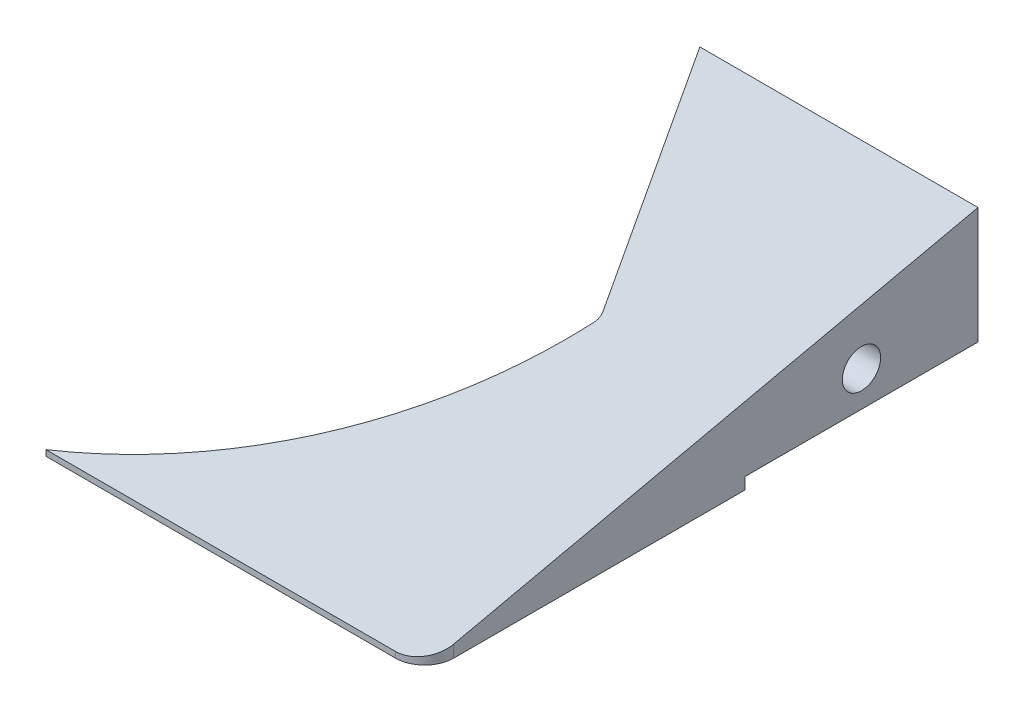
ISO-10303-21;
HEADER;
FILE_DESCRIPTION(('STEP AP214'),'2;1');
FILE_NAME('part.step','',(''),(''),'','','');
FILE_SCHEMA(('AUTOMOTIVE_DESIGN { 1 0 10303 214 1 1 1 1 }'));
ENDSEC;
DATA;
#1=APPLICATION_CONTEXT('core data for automotive mechanical design processes');
#2=APPLICATION_PROTOCOL_DEFINITION('international standard','automotive_design',2000,#1);
#3=PRODUCT_CONTEXT('',#1,'mechanical');
#4=PRODUCT('Part','Part','',(#3));
#5=PRODUCT_RELATED_PRODUCT_CATEGORY('part','',(#4));
#6=PRODUCT_DEFINITION_FORMATION('','',#4);
#7=PRODUCT_DEFINITION_CONTEXT('part definition',#1,'design');
#8=PRODUCT_DEFINITION('design','',#6,#7);
#9=PRODUCT_DEFINITION_SHAPE('','',#8);
#10=(LENGTH_UNIT() NAMED_UNIT(*) SI_UNIT(.MILLI.,.METRE.));
#11=(NAMED_UNIT(*) PLANE_ANGLE_UNIT() SI_UNIT($,.RADIAN.));
#12=(NAMED_UNIT(*) SI_UNIT($,.STERADIAN.) SOLID_ANGLE_UNIT());
#13=UNCERTAINTY_MEASURE_WITH_UNIT(LENGTH_MEASURE(1.E-05),#10,'distance_accuracy_value','');
#14=(GEOMETRIC_REPRESENTATION_CONTEXT(3) GLOBAL_UNCERTAINTY_ASSIGNED_CONTEXT((#13)) GLOBAL_UNIT_ASSIGNED_CONTEXT((#10,
#11,#12)) REPRESENTATION_CONTEXT('',''));
#15=CARTESIAN_POINT('',(0.,0.,0.));
#16=DIRECTION('',(0.,0.,1.));
#17=DIRECTION('',(1.,0.,0.));
#18=AXIS2_PLACEMENT_3D('',#15,#16,#17);
#19=CARTESIAN_POINT('',(-65.,-11.,95.));
#20=DIRECTION('',(0.,1.,0.));
#21=DIRECTION('',(0.,0.,1.));
#22=AXIS2_PLACEMENT_3D('',#19,#20,#21);
#23=PLANE('',#22);
#24=DIRECTION('',(-1.,0.,0.));
#25=VECTOR('',#24,1.);
#26=CARTESIAN_POINT('',(65.,-11.,40.));
#27=LINE('',#26,#25);
#28=CARTESIAN_POINT('',(65.,-11.,40.));
#29=VERTEX_POINT('',#28);
#30=CARTESIAN_POINT('',(40.2,-11.,40.));
#31=VERTEX_POINT('',#30);
#32=EDGE_CURVE('E127',#29,#31,#27,.T.);
#33=ORIENTED_EDGE('',*,*,#32,.F.);
#34=DIRECTION('',(0.,0.,-1.));
#35=VECTOR('',#34,1.);
#36=CARTESIAN_POINT('',(65.,-11.,95.));
#37=LINE('',#36,#35);
#38=CARTESIAN_POINT('',(65.,-11.,90.));
#39=VERTEX_POINT('',#38);
#40=EDGE_CURVE('E139',#39,#29,#37,.T.);
#41=ORIENTED_EDGE('',*,*,#40,.F.);
#42=CARTESIAN_POINT('',(60.,-11.,90.));
#43=DIRECTION('',(0.,1.,0.));
#44=DIRECTION('',(0.,0.,1.));
#45=AXIS2_PLACEMENT_3D('',#42,#43,#44);
#46=CIRCLE('',#45,5.);
#47=CARTESIAN_POINT('',(60.,-11.,95.));
#48=VERTEX_POINT('',#47);
#49=EDGE_CURVE('E164',#39,#48,#46,.F.);
#50=ORIENTED_EDGE('',*,*,#49,.T.);
#51=DIRECTION('',(1.,0.,0.));
#52=VECTOR('',#51,1.);
#53=CARTESIAN_POINT('',(-65.,-11.,95.));
#54=LINE('',#53,#52);
#55=CARTESIAN_POINT('',(0.,-11.,95.));
#56=VERTEX_POINT('',#55);
#57=EDGE_CURVE('E149',#56,#48,#54,.T.);
#58=ORIENTED_EDGE('',*,*,#57,.F.);
#59=CARTESIAN_POINT('',(-32.4549993385958,-11.,29.0870732106991));
#60=DIRECTION('',(0.,1.,0.));
#61=DIRECTION('',(0.,0.,1.));
#62=AXIS2_PLACEMENT_3D('',#59,#60,#61);
#63=CIRCLE('',#62,73.47);
#64=EDGE_CURVE('E142',#31,#56,#63,.F.);
#65=ORIENTED_EDGE('',*,*,#64,.F.);
#66=EDGE_LOOP('',(#33,#41,#50,#58,#65));
#67=FACE_BOUND('',#66,.T.);
#68=ADVANCED_FACE('F48',(#67),#23,.F.);
#69=CARTESIAN_POINT('',(65.,11.,95.));
#70=DIRECTION('',(-1.,0.,0.));
#71=DIRECTION('',(0.,0.,1.));
#72=AXIS2_PLACEMENT_3D('',#69,#70,#71);
#73=PLANE('',#72);
#74=CARTESIAN_POINT('',(65.,-2.945,20.));
#75=DIRECTION('',(1.,0.,0.));
#76=DIRECTION('',(0.,0.,-1.));
#77=AXIS2_PLACEMENT_3D('',#74,#75,#76);
#78=CIRCLE('',#77,3.2899985);
#79=CARTESIAN_POINT('',(65.,-2.945,16.7100015));
#80=VERTEX_POINT('',#79);
#81=EDGE_CURVE('E198',#80,#80,#78,.T.);
#82=ORIENTED_EDGE('',*,*,#81,.F.);
#83=EDGE_LOOP('',(#82));
#84=FACE_BOUND('',#83,.T.);
#85=DIRECTION('',(0.,-1.,0.));
#86=VECTOR('',#85,1.);
#87=CARTESIAN_POINT('',(65.,-9.,40.));
#88=LINE('',#87,#86);
#89=CARTESIAN_POINT('',(65.,-9.,40.));
#90=VERTEX_POINT('',#89);
#91=EDGE_CURVE('E123',#90,#29,#88,.T.);
#92=ORIENTED_EDGE('',*,*,#91,.F.);
#93=DIRECTION('',(0.,0.,-1.));
#94=VECTOR('',#93,1.);
#95=CARTESIAN_POINT('',(65.,-9.,40.));
#96=LINE('',#95,#94);
#97=CARTESIAN_POINT('',(65.,-9.,0.));
#98=VERTEX_POINT('',#97);
#99=EDGE_CURVE('E188',#90,#98,#96,.T.);
#100=ORIENTED_EDGE('',*,*,#99,.T.);
#101=DIRECTION('',(0.,1.,0.));
#102=VECTOR('',#101,1.);
#103=CARTESIAN_POINT('',(65.,11.,0.));
#104=LINE('',#103,#102);
#105=CARTESIAN_POINT('',(65.,11.,0.));
#106=VERTEX_POINT('',#105);
#107=EDGE_CURVE('E215',#98,#106,#104,.T.);
#108=ORIENTED_EDGE('',*,*,#107,.T.);
#109=DIRECTION('',(0.,-0.215842043801446,0.976428293387494));
#110=VECTOR('',#109,1.);
#111=CARTESIAN_POINT('',(65.,-9.02165645467991,90.5741601521234));
#112=LINE('',#111,#110);
#113=CARTESIAN_POINT('',(65.,-8.89473684210526,90.));
#114=VERTEX_POINT('',#113);
#115=EDGE_CURVE('E208',#106,#114,#112,.T.);
#116=ORIENTED_EDGE('',*,*,#115,.T.);
#117=DIRECTION('',(0.,1.,0.));
#118=VECTOR('',#117,1.);
#119=CARTESIAN_POINT('',(65.,-11.,90.));
#120=LINE('',#119,#118);
#121=EDGE_CURVE('E147',#114,#39,#120,.F.);
#122=ORIENTED_EDGE('',*,*,#121,.T.);
#123=ORIENTED_EDGE('',*,*,#40,.T.);
#124=EDGE_LOOP('',(#92,#100,#108,#116,#122,#123));
#125=FACE_BOUND('',#124,.T.);
#126=ADVANCED_FACE('F144',(#84,#125),#73,.F.);
#127=CARTESIAN_POINT('',(0.,0.,95.));
#128=DIRECTION('',(0.,0.,1.));
#129=DIRECTION('',(1.,0.,0.));
#130=AXIS2_PLACEMENT_3D('',#127,#128,#129);
#131=PLANE('',#130);
#132=ORIENTED_EDGE('',*,*,#57,.T.);
#133=DIRECTION('',(0.,1.,0.));
#134=VECTOR('',#133,1.);
#135=CARTESIAN_POINT('',(60.,-10.,95.));
#136=LINE('',#135,#134);
#137=CARTESIAN_POINT('',(60.,-10.,95.));
#138=VERTEX_POINT('',#137);
#139=EDGE_CURVE('E151',#48,#138,#136,.T.);
#140=ORIENTED_EDGE('',*,*,#139,.T.);
#141=DIRECTION('',(-1.,0.,0.));
#142=VECTOR('',#141,1.);
#143=CARTESIAN_POINT('',(211.490187384685,-9.99999999999995,95.));
#144=LINE('',#143,#142);
#145=CARTESIAN_POINT('',(0.,-10.,95.));
#146=VERTEX_POINT('',#145);
#147=EDGE_CURVE('E204',#138,#146,#144,.T.);
#148=ORIENTED_EDGE('',*,*,#147,.T.);
#149=DIRECTION('',(0.,1.,0.));
#150=VECTOR('',#149,1.);
#151=CARTESIAN_POINT('',(0.,-11.001,95.));
#152=LINE('',#151,#150);
#153=EDGE_CURVE('E210',#56,#146,#152,.T.);
#154=ORIENTED_EDGE('',*,*,#153,.F.);
#155=EDGE_LOOP('',(#132,#140,#148,#154));
#156=FACE_BOUND('',#155,.T.);
#157=ADVANCED_FACE('F226',(#156),#131,.T.);
#158=CARTESIAN_POINT('',(0.,0.,0.));
#159=DIRECTION('',(0.,0.,1.));
#160=DIRECTION('',(1.,0.,0.));
#161=AXIS2_PLACEMENT_3D('',#158,#159,#160);
#162=PLANE('',#161);
#163=ORIENTED_EDGE('',*,*,#107,.F.);
#164=DIRECTION('',(1.,0.,0.));
#165=VECTOR('',#164,1.);
#166=CARTESIAN_POINT('',(17.25,-9.,0.));
#167=LINE('',#166,#165);
#168=CARTESIAN_POINT('',(17.25,-9.,0.));
#169=VERTEX_POINT('',#168);
#170=EDGE_CURVE('E134',#169,#98,#167,.T.);
#171=ORIENTED_EDGE('',*,*,#170,.F.);
#172=DIRECTION('',(0.,1.,0.));
#173=VECTOR('',#172,1.);
#174=CARTESIAN_POINT('',(17.25,-11.001,0.));
#175=LINE('',#174,#173);
#176=CARTESIAN_POINT('',(17.25,11.,0.));
#177=VERTEX_POINT('',#176);
#178=EDGE_CURVE('E186',#169,#177,#175,.T.);
#179=ORIENTED_EDGE('',*,*,#178,.T.);
#180=DIRECTION('',(-1.,0.,0.));
#181=VECTOR('',#180,1.);
#182=CARTESIAN_POINT('',(-65.,11.,0.));
#183=LINE('',#182,#181);
#184=EDGE_CURVE('E154',#106,#177,#183,.T.);
#185=ORIENTED_EDGE('',*,*,#184,.F.);
#186=EDGE_LOOP('',(#163,#171,#179,#185));
#187=FACE_BOUND('',#186,.T.);
#188=ADVANCED_FACE('F223',(#187),#162,.F.);
#189=CARTESIAN_POINT('',(40.2,-11.001,40.));
#190=DIRECTION('',(0.867374440844356,0.,-0.497656085434449));
#191=DIRECTION('',(-0.497656085434449,0.,-0.867374440844356));
#192=AXIS2_PLACEMENT_3D('',#189,#190,#191);
#193=PLANE('',#192);
#194=CARTESIAN_POINT('',(27.203121708689,-2.945,17.3474888168871));
#195=DIRECTION('',(-0.867374440844356,0.,0.497656085434449));
#196=DIRECTION('',(0.49765608543445,0.,0.867374440844357));
#197=AXIS2_PLACEMENT_3D('',#194,#195,#196);
#198=CIRCLE('',#197,3.28999849999999);
#199=CARTESIAN_POINT('',(28.8404094832842,-2.945,20.2011494262034));
#200=VERTEX_POINT('',#199);
#201=EDGE_CURVE('E187',#200,#200,#198,.T.);
#202=ORIENTED_EDGE('',*,*,#201,.F.);
#203=EDGE_LOOP('',(#202));
#204=FACE_BOUND('',#203,.T.);
#205=DIRECTION('',(0.497656085434449,0.,0.867374440844356));
#206=VECTOR('',#205,1.);
#207=CARTESIAN_POINT('',(40.2,-9.,40.));
#208=LINE('',#207,#206);
#209=CARTESIAN_POINT('',(39.6741928814548,-9.,39.0835605776989));
#210=VERTEX_POINT('',#209);
#211=EDGE_CURVE('E180',#169,#210,#208,.T.);
#212=ORIENTED_EDGE('',*,*,#211,.T.);
#213=DIRECTION('',(0.,-1.,0.));
#214=VECTOR('',#213,1.);
#215=CARTESIAN_POINT('',(39.6741928814548,2.15789473684209,39.0835605776989));
#216=LINE('',#215,#214);
#217=CARTESIAN_POINT('',(39.6741928814548,2.36047608282443,39.0835605776989));
#218=VERTEX_POINT('',#217);
#219=EDGE_CURVE('E166',#210,#218,#216,.F.);
#220=ORIENTED_EDGE('',*,*,#219,.T.);
#221=DIRECTION('',(-0.48875328158422,0.188305357885905,-0.851857571388619));
#222=VECTOR('',#221,1.);
#223=CARTESIAN_POINT('',(41.4110770560014,1.69129470150614,42.1108096836626));
#224=LINE('',#223,#222);
#225=EDGE_CURVE('E206',#218,#177,#224,.T.);
#226=ORIENTED_EDGE('',*,*,#225,.T.);
#227=ORIENTED_EDGE('',*,*,#178,.F.);
#228=EDGE_LOOP('',(#212,#220,#226,#227));
#229=FACE_BOUND('',#228,.T.);
#230=ADVANCED_FACE('F184',(#204,#229),#193,.F.);
#231=CARTESIAN_POINT('',(-32.4549993385958,-11.001,29.0870732106991));
#232=DIRECTION('',(0.,1.,0.));
#233=DIRECTION('',(0.,0.,1.));
#234=AXIS2_PLACEMENT_3D('',#231,#232,#233);
#235=CYLINDRICAL_SURFACE('',#234,73.47);
#236=CARTESIAN_POINT('',(-32.4549993385958,4.57022592184543,29.0870732106991));
#237=DIRECTION('',(0.,-0.976428293387494,-0.215842043801446));
#238=DIRECTION('',(0.,0.215842043801446,-0.976428293387494));
#239=AXIS2_PLACEMENT_3D('',#236,#237,#238);
#240=ELLIPSE('',#239,75.2436205480207,73.47);
#241=CARTESIAN_POINT('',(40.0319277495355,1.92233000532617,41.0656499759054));
#242=VERTEX_POINT('',#241);
#243=EDGE_CURVE('E148',#146,#242,#240,.F.);
#244=ORIENTED_EDGE('',*,*,#243,.T.);
#245=DIRECTION('',(0.,1.,0.));
#246=VECTOR('',#245,1.);
#247=CARTESIAN_POINT('',(40.0319277495355,-11.001,41.0656499759054));
#248=LINE('',#247,#246);
#249=CARTESIAN_POINT('',(40.0319277495355,-9.,41.0656499759054));
#250=VERTEX_POINT('',#249);
#251=EDGE_CURVE('E170',#242,#250,#248,.F.);
#252=ORIENTED_EDGE('',*,*,#251,.T.);
#253=CARTESIAN_POINT('',(-32.4549993385958,-8.99999999999999,29.0870732106991));
#254=DIRECTION('',(0.,1.,0.));
#255=DIRECTION('',(-1.,0.,0.));
#256=AXIS2_PLACEMENT_3D('',#253,#254,#255);
#257=CIRCLE('',#256,73.47);
#258=CARTESIAN_POINT('',(40.2,-9.,40.));
#259=VERTEX_POINT('',#258);
#260=EDGE_CURVE('E62',#250,#259,#257,.T.);
#261=ORIENTED_EDGE('',*,*,#260,.T.);
#262=DIRECTION('',(0.,1.,0.));
#263=VECTOR('',#262,1.);
#264=CARTESIAN_POINT('',(40.2,-11.001,40.));
#265=LINE('',#264,#263);
#266=EDGE_CURVE('E212',#31,#259,#265,.T.);
#267=ORIENTED_EDGE('',*,*,#266,.F.);
#268=ORIENTED_EDGE('',*,*,#64,.T.);
#269=ORIENTED_EDGE('',*,*,#153,.T.);
#270=EDGE_LOOP('',(#244,#252,#261,#267,#268,#269));
#271=FACE_BOUND('',#270,.T.);
#272=ADVANCED_FACE('F174',(#271),#235,.F.);
#273=CARTESIAN_POINT('',(211.490187384685,11.0000000000001,0.));
#274=DIRECTION('',(0.,-0.976428293387494,-0.215842043801446));
#275=DIRECTION('',(0.,0.215842043801446,-0.976428293387494));
#276=AXIS2_PLACEMENT_3D('',#273,#274,#275);
#277=PLANE('',#276);
#278=ORIENTED_EDGE('',*,*,#147,.F.);
#279=CARTESIAN_POINT('',(60.,-8.89473684210526,90.));
#280=DIRECTION('',(0.,-0.976428293387494,-0.215842043801446));
#281=DIRECTION('',(0.,-0.215842043801446,0.976428293387494));
#282=AXIS2_PLACEMENT_3D('',#279,#280,#281);
#283=ELLIPSE('',#282,5.12070372587591,5.);
#284=EDGE_CURVE('E161',#138,#114,#283,.F.);
#285=ORIENTED_EDGE('',*,*,#284,.T.);
#286=ORIENTED_EDGE('',*,*,#115,.F.);
#287=ORIENTED_EDGE('',*,*,#184,.T.);
#288=ORIENTED_EDGE('',*,*,#225,.F.);
#289=CARTESIAN_POINT('',(37.0720695589217,2.03045152090474,40.5765288340023));
#290=DIRECTION('',(0.,-0.976428293387494,-0.215842043801446));
#291=DIRECTION('',(0.,0.215842043801446,-0.976428293387494));
#292=AXIS2_PLACEMENT_3D('',#289,#290,#291);
#293=ELLIPSE('',#292,3.07242223552555,3.);
#294=EDGE_CURVE('E56',#218,#242,#293,.T.);
#295=ORIENTED_EDGE('',*,*,#294,.T.);
#296=ORIENTED_EDGE('',*,*,#243,.F.);
#297=EDGE_LOOP('',(#278,#285,#286,#287,#288,#295,#296));
#298=FACE_BOUND('',#297,.T.);
#299=ADVANCED_FACE('F221',(#298),#277,.F.);
#300=CARTESIAN_POINT('',(55.,-2.945,20.));
#301=DIRECTION('',(1.,0.,0.));
#302=DIRECTION('',(0.,0.,-1.));
#303=AXIS2_PLACEMENT_3D('',#300,#301,#302);
#304=CONICAL_SURFACE('',#303,3.2899985,1.02974425867665);
#305=CARTESIAN_POINT('',(53.0231694646903,-2.945,20.));
#306=VERTEX_POINT('',#305);
#307=VERTEX_LOOP('',#306);
#308=FACE_BOUND('',#307,.T.);
#309=CARTESIAN_POINT('',(55.,-2.945,20.));
#310=DIRECTION('',(1.,0.,0.));
#311=DIRECTION('',(0.,0.,-1.));
#312=AXIS2_PLACEMENT_3D('',#309,#310,#311);
#313=CIRCLE('',#312,3.2899985);
#314=CARTESIAN_POINT('',(55.,-2.945,16.7100015));
#315=VERTEX_POINT('',#314);
#316=EDGE_CURVE('E201',#315,#315,#313,.T.);
#317=ORIENTED_EDGE('',*,*,#316,.T.);
#318=EDGE_LOOP('',(#317));
#319=FACE_BOUND('',#318,.T.);
#320=ADVANCED_FACE('F269',(#308,#319),#304,.F.);
#321=CARTESIAN_POINT('',(65.,-2.945,20.));
#322=DIRECTION('',(1.,0.,0.));
#323=DIRECTION('',(0.,0.,-1.));
#324=AXIS2_PLACEMENT_3D('',#321,#322,#323);
#325=CYLINDRICAL_SURFACE('',#324,3.2899985);
#326=ORIENTED_EDGE('',*,*,#316,.F.);
#327=EDGE_LOOP('',(#326));
#328=FACE_BOUND('',#327,.T.);
#329=ORIENTED_EDGE('',*,*,#81,.T.);
#330=EDGE_LOOP('',(#329));
#331=FACE_BOUND('',#330,.T.);
#332=ADVANCED_FACE('F260',(#328,#331),#325,.F.);
#333=CARTESIAN_POINT('',(35.8768661171326,-2.945,12.3709279625426));
#334=DIRECTION('',(-0.867374440844356,0.,0.497656085434449));
#335=DIRECTION('',(0.49765608543445,0.,0.867374440844357));
#336=AXIS2_PLACEMENT_3D('',#333,#334,#335);
#337=CONICAL_SURFACE('',#336,3.28999849999999,1.02974425867665);
#338=CARTESIAN_POINT('',(37.5915183973409,-2.945,11.3871462167731));
#339=VERTEX_POINT('',#338);
#340=VERTEX_LOOP('',#339);
#341=FACE_BOUND('',#340,.T.);
#342=CARTESIAN_POINT('',(35.8768661171326,-2.945,12.3709279625426));
#343=DIRECTION('',(-0.867374440844356,0.,0.497656085434449));
#344=DIRECTION('',(0.49765608543445,0.,0.867374440844357));
#345=AXIS2_PLACEMENT_3D('',#342,#343,#344);
#346=CIRCLE('',#345,3.28999849999999);
#347=CARTESIAN_POINT('',(37.5141538917278,-2.945,15.2245885718589));
#348=VERTEX_POINT('',#347);
#349=EDGE_CURVE('E191',#348,#348,#346,.T.);
#350=ORIENTED_EDGE('',*,*,#349,.T.);
#351=EDGE_LOOP('',(#350));
#352=FACE_BOUND('',#351,.T.);
#353=ADVANCED_FACE('F252',(#341,#352),#337,.F.);
#354=CARTESIAN_POINT('',(27.203121708689,-2.945,17.3474888168871));
#355=DIRECTION('',(-0.867374440844356,0.,0.497656085434449));
#356=DIRECTION('',(0.49765608543445,0.,0.867374440844357));
#357=AXIS2_PLACEMENT_3D('',#354,#355,#356);
#358=CYLINDRICAL_SURFACE('',#357,3.28999849999999);
#359=ORIENTED_EDGE('',*,*,#349,.F.);
#360=EDGE_LOOP('',(#359));
#361=FACE_BOUND('',#360,.T.);
#362=ORIENTED_EDGE('',*,*,#201,.T.);
#363=EDGE_LOOP('',(#362));
#364=FACE_BOUND('',#363,.T.);
#365=ADVANCED_FACE('F245',(#361,#364),#358,.F.);
#366=CARTESIAN_POINT('',(60.,0.,90.));
#367=DIRECTION('',(0.,-1.,0.));
#368=DIRECTION('',(0.,0.,-1.));
#369=AXIS2_PLACEMENT_3D('',#366,#367,#368);
#370=CYLINDRICAL_SURFACE('',#369,5.);
#371=ORIENTED_EDGE('',*,*,#49,.F.);
#372=ORIENTED_EDGE('',*,*,#121,.F.);
#373=ORIENTED_EDGE('',*,*,#284,.F.);
#374=ORIENTED_EDGE('',*,*,#139,.F.);
#375=EDGE_LOOP('',(#371,#372,#373,#374));
#376=FACE_BOUND('',#375,.T.);
#377=ADVANCED_FACE('F243',(#376),#370,.T.);
#378=CARTESIAN_POINT('',(17.25,-9.,40.));
#379=DIRECTION('',(0.,1.,0.));
#380=DIRECTION('',(-1.,0.,0.));
#381=AXIS2_PLACEMENT_3D('',#378,#379,#380);
#382=PLANE('',#381);
#383=ORIENTED_EDGE('',*,*,#170,.T.);
#384=ORIENTED_EDGE('',*,*,#99,.F.);
#385=DIRECTION('',(1.,0.,0.));
#386=VECTOR('',#385,1.);
#387=CARTESIAN_POINT('',(17.25,-9.,40.));
#388=LINE('',#387,#386);
#389=EDGE_CURVE('E129',#259,#90,#388,.T.);
#390=ORIENTED_EDGE('',*,*,#389,.F.);
#391=ORIENTED_EDGE('',*,*,#260,.F.);
#392=CARTESIAN_POINT('',(37.0720695589217,-9.,40.5765288340023));
#393=DIRECTION('',(0.,1.,0.));
#394=DIRECTION('',(-1.,0.,0.));
#395=AXIS2_PLACEMENT_3D('',#392,#393,#394);
#396=CIRCLE('',#395,3.);
#397=EDGE_CURVE('E13',#250,#210,#396,.T.);
#398=ORIENTED_EDGE('',*,*,#397,.T.);
#399=ORIENTED_EDGE('',*,*,#211,.F.);
#400=EDGE_LOOP('',(#383,#384,#390,#391,#398,#399));
#401=FACE_BOUND('',#400,.T.);
#402=ADVANCED_FACE('F179',(#401),#382,.F.);
#403=CARTESIAN_POINT('',(0.,0.,40.));
#404=DIRECTION('',(0.,0.,-1.));
#405=DIRECTION('',(-1.,0.,0.));
#406=AXIS2_PLACEMENT_3D('',#403,#404,#405);
#407=PLANE('',#406);
#408=ORIENTED_EDGE('',*,*,#266,.T.);
#409=ORIENTED_EDGE('',*,*,#389,.T.);
#410=ORIENTED_EDGE('',*,*,#91,.T.);
#411=ORIENTED_EDGE('',*,*,#32,.T.);
#412=EDGE_LOOP('',(#408,#409,#410,#411));
#413=FACE_BOUND('',#412,.T.);
#414=ADVANCED_FACE('F126',(#413),#407,.T.);
#415=CARTESIAN_POINT('',(37.0720695589217,-11.001,40.5765288340023));
#416=DIRECTION('',(0.,1.,0.));
#417=DIRECTION('',(0.,0.,1.));
#418=AXIS2_PLACEMENT_3D('',#415,#416,#417);
#419=CYLINDRICAL_SURFACE('',#418,3.);
#420=ORIENTED_EDGE('',*,*,#397,.F.);
#421=ORIENTED_EDGE('',*,*,#251,.F.);
#422=ORIENTED_EDGE('',*,*,#294,.F.);
#423=ORIENTED_EDGE('',*,*,#219,.F.);
#424=EDGE_LOOP('',(#420,#421,#422,#423));
#425=FACE_BOUND('',#424,.T.);
#426=ADVANCED_FACE('F50',(#425),#419,.F.);
#427=CLOSED_SHELL('',(#68,#126,#157,#188,#230,#272,#299,#320,#332,#353,#365,#377,#402,#414,#426));
#428=MANIFOLD_SOLID_BREP('B2',#427);
#429=ADVANCED_BREP_SHAPE_REPRESENTATION('',(#18,#428),#14);
#430=SHAPE_DEFINITION_REPRESENTATION(#9,#429);
ENDSEC;
END-ISO-10303-21;
